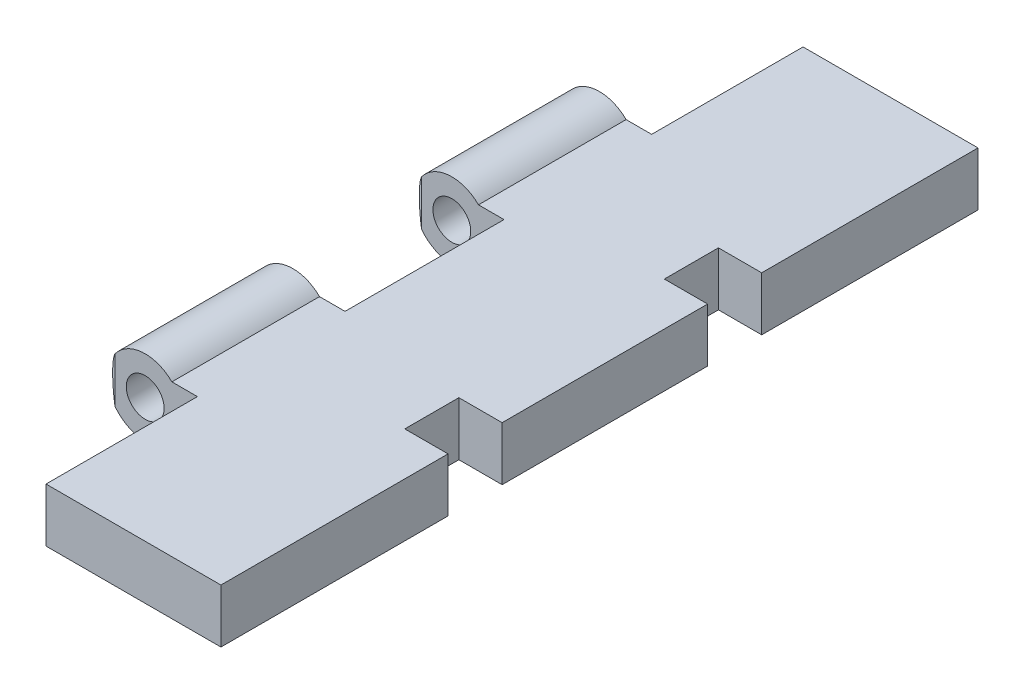
ISO-10303-21;
HEADER;
FILE_DESCRIPTION(('STEP AP214'),'2;1');
FILE_NAME('part.step','',(''),(''),'','','');
FILE_SCHEMA(('AUTOMOTIVE_DESIGN { 1 0 10303 214 1 1 1 1 }'));
ENDSEC;
DATA;
#1=APPLICATION_CONTEXT('core data for automotive mechanical design processes');
#2=APPLICATION_PROTOCOL_DEFINITION('international standard','automotive_design',2000,#1);
#3=PRODUCT_CONTEXT('',#1,'mechanical');
#4=PRODUCT('Part','Part','',(#3));
#5=PRODUCT_RELATED_PRODUCT_CATEGORY('part','',(#4));
#6=PRODUCT_DEFINITION_FORMATION('','',#4);
#7=PRODUCT_DEFINITION_CONTEXT('part definition',#1,'design');
#8=PRODUCT_DEFINITION('design','',#6,#7);
#9=PRODUCT_DEFINITION_SHAPE('','',#8);
#10=(LENGTH_UNIT() NAMED_UNIT(*) SI_UNIT(.MILLI.,.METRE.));
#11=(NAMED_UNIT(*) PLANE_ANGLE_UNIT() SI_UNIT($,.RADIAN.));
#12=(NAMED_UNIT(*) SI_UNIT($,.STERADIAN.) SOLID_ANGLE_UNIT());
#13=UNCERTAINTY_MEASURE_WITH_UNIT(LENGTH_MEASURE(1.E-05),#10,'distance_accuracy_value','');
#14=(GEOMETRIC_REPRESENTATION_CONTEXT(3) GLOBAL_UNCERTAINTY_ASSIGNED_CONTEXT((#13)) GLOBAL_UNIT_ASSIGNED_CONTEXT((#10,
#11,#12)) REPRESENTATION_CONTEXT('',''));
#15=CARTESIAN_POINT('',(0.,0.,0.));
#16=DIRECTION('',(0.,0.,1.));
#17=DIRECTION('',(1.,0.,0.));
#18=AXIS2_PLACEMENT_3D('',#15,#16,#17);
#19=CARTESIAN_POINT('',(87.6698011843901,4.79250337128365,32.453922738806));
#20=DIRECTION('',(-1.,0.,0.));
#21=DIRECTION('',(0.,0.,1.));
#22=AXIS2_PLACEMENT_3D('',#19,#20,#21);
#23=PLANE('',#22);
#24=DIRECTION('',(0.,0.,-1.));
#25=VECTOR('',#24,1.);
#26=CARTESIAN_POINT('',(87.6698011843901,2.30750337128365,32.453922738806));
#27=LINE('',#26,#25);
#28=CARTESIAN_POINT('',(87.6698011843901,2.30750337128365,54.453922738806));
#29=VERTEX_POINT('',#28);
#30=CARTESIAN_POINT('',(87.6698011843901,2.30750337128365,44.953922738806));
#31=VERTEX_POINT('',#30);
#32=EDGE_CURVE('E332',#29,#31,#27,.T.);
#33=ORIENTED_EDGE('',*,*,#32,.T.);
#34=DIRECTION('',(0.,1.,0.));
#35=VECTOR('',#34,1.);
#36=CARTESIAN_POINT('',(87.6698011843901,4.79250337128365,44.953922738806));
#37=LINE('',#36,#35);
#38=CARTESIAN_POINT('',(87.6698011843901,4.79250337128365,44.953922738806));
#39=VERTEX_POINT('',#38);
#40=EDGE_CURVE('E207',#31,#39,#37,.T.);
#41=ORIENTED_EDGE('',*,*,#40,.T.);
#42=DIRECTION('',(0.,0.,-1.));
#43=VECTOR('',#42,1.);
#44=CARTESIAN_POINT('',(87.6698011843901,4.79250337128365,32.453922738806));
#45=LINE('',#44,#43);
#46=CARTESIAN_POINT('',(87.6698011843901,4.79250337128365,54.453922738806));
#47=VERTEX_POINT('',#46);
#48=EDGE_CURVE('E324',#47,#39,#45,.T.);
#49=ORIENTED_EDGE('',*,*,#48,.F.);
#50=DIRECTION('',(0.,1.,0.));
#51=VECTOR('',#50,1.);
#52=CARTESIAN_POINT('',(87.6698011843901,1.80000337128365,54.453922738806));
#53=LINE('',#52,#51);
#54=EDGE_CURVE('E379',#29,#47,#53,.T.);
#55=ORIENTED_EDGE('',*,*,#54,.F.);
#56=EDGE_LOOP('',(#33,#41,#49,#55));
#57=FACE_BOUND('',#56,.T.);
#58=ADVANCED_FACE('F38',(#57),#23,.F.);
#59=CARTESIAN_POINT('',(87.6698011843901,4.79250337128365,42.453922738806));
#60=VERTEX_POINT('',#59);
#61=CARTESIAN_POINT('',(87.6698011843901,4.79250337128365,32.453922738806));
#62=VERTEX_POINT('',#61);
#63=EDGE_CURVE('E319',#60,#62,#45,.T.);
#64=ORIENTED_EDGE('',*,*,#63,.F.);
#65=DIRECTION('',(0.,1.,0.));
#66=VECTOR('',#65,1.);
#67=CARTESIAN_POINT('',(87.6698011843901,1.80000337128365,42.453922738806));
#68=LINE('',#67,#66);
#69=CARTESIAN_POINT('',(87.6698011843901,2.30750337128365,42.453922738806));
#70=VERTEX_POINT('',#69);
#71=EDGE_CURVE('E53',#70,#60,#68,.T.);
#72=ORIENTED_EDGE('',*,*,#71,.F.);
#73=CARTESIAN_POINT('',(87.6698011843901,2.30750337128365,32.453922738806));
#74=VERTEX_POINT('',#73);
#75=EDGE_CURVE('E329',#70,#74,#27,.T.);
#76=ORIENTED_EDGE('',*,*,#75,.T.);
#77=DIRECTION('',(0.,-1.,0.));
#78=VECTOR('',#77,1.);
#79=CARTESIAN_POINT('',(87.6698011843901,4.79250337128365,32.453922738806));
#80=LINE('',#79,#78);
#81=EDGE_CURVE('E327',#62,#74,#80,.T.);
#82=ORIENTED_EDGE('',*,*,#81,.F.);
#83=EDGE_LOOP('',(#64,#72,#76,#82));
#84=FACE_BOUND('',#83,.T.);
#85=ADVANCED_FACE('F408',(#84),#23,.F.);
#86=CARTESIAN_POINT('',(79.5830511843904,2.30750337128365,60.453922738806));
#87=DIRECTION('',(1.,0.,0.));
#88=DIRECTION('',(0.,0.,-1.));
#89=AXIS2_PLACEMENT_3D('',#86,#87,#88);
#90=PLANE('',#89);
#91=DIRECTION('',(0.,0.,-1.));
#92=VECTOR('',#91,1.);
#93=CARTESIAN_POINT('',(79.5830511843904,4.79250337128365,60.453922738806));
#94=LINE('',#93,#92);
#95=CARTESIAN_POINT('',(79.5830511843904,4.79250337128365,67.453922738806));
#96=VERTEX_POINT('',#95);
#97=CARTESIAN_POINT('',(79.5830511843904,4.79250337128365,60.453922738806));
#98=VERTEX_POINT('',#97);
#99=EDGE_CURVE('E306',#96,#98,#94,.T.);
#100=ORIENTED_EDGE('',*,*,#99,.T.);
#101=DIRECTION('',(0.,1.,0.));
#102=VECTOR('',#101,1.);
#103=CARTESIAN_POINT('',(79.5830511843904,2.30750337128365,60.453922738806));
#104=LINE('',#103,#102);
#105=CARTESIAN_POINT('',(79.5830511843904,2.30750337128365,60.453922738806));
#106=VERTEX_POINT('',#105);
#107=EDGE_CURVE('E295',#106,#98,#104,.T.);
#108=ORIENTED_EDGE('',*,*,#107,.F.);
#109=DIRECTION('',(0.,0.,-1.));
#110=VECTOR('',#109,1.);
#111=CARTESIAN_POINT('',(79.5830511843904,2.30750337128365,60.453922738806));
#112=LINE('',#111,#110);
#113=CARTESIAN_POINT('',(79.5830511843904,2.30750337128365,67.453922738806));
#114=VERTEX_POINT('',#113);
#115=EDGE_CURVE('E305',#114,#106,#112,.T.);
#116=ORIENTED_EDGE('',*,*,#115,.F.);
#117=DIRECTION('',(0.,1.,0.));
#118=VECTOR('',#117,1.);
#119=CARTESIAN_POINT('',(79.5830511843904,2.30750337128365,67.453922738806));
#120=LINE('',#119,#118);
#121=EDGE_CURVE('E309',#114,#96,#120,.T.);
#122=ORIENTED_EDGE('',*,*,#121,.T.);
#123=EDGE_LOOP('',(#100,#108,#116,#122));
#124=FACE_BOUND('',#123,.T.);
#125=ADVANCED_FACE('F479',(#124),#90,.F.);
#126=CARTESIAN_POINT('',(77.1698011843901,4.79250337128365,67.453922738806));
#127=DIRECTION('',(0.,0.,-1.));
#128=DIRECTION('',(-1.,0.,0.));
#129=AXIS2_PLACEMENT_3D('',#126,#127,#128);
#130=PLANE('',#129);
#131=DIRECTION('',(1.,0.,0.));
#132=VECTOR('',#131,1.);
#133=CARTESIAN_POINT('',(77.1698011843901,4.79250337128365,67.453922738806));
#134=LINE('',#133,#132);
#135=CARTESIAN_POINT('',(87.6698011843901,4.79250337128365,67.453922738806));
#136=VERTEX_POINT('',#135);
#137=EDGE_CURVE('E317',#96,#136,#134,.T.);
#138=ORIENTED_EDGE('',*,*,#137,.F.);
#139=ORIENTED_EDGE('',*,*,#121,.F.);
#140=DIRECTION('',(1.,0.,0.));
#141=VECTOR('',#140,1.);
#142=CARTESIAN_POINT('',(77.1698011843901,2.30750337128365,67.453922738806));
#143=LINE('',#142,#141);
#144=CARTESIAN_POINT('',(87.6698011843901,2.30750337128365,67.453922738806));
#145=VERTEX_POINT('',#144);
#146=EDGE_CURVE('E278',#114,#145,#143,.T.);
#147=ORIENTED_EDGE('',*,*,#146,.T.);
#148=DIRECTION('',(0.,-1.,0.));
#149=VECTOR('',#148,1.);
#150=CARTESIAN_POINT('',(87.6698011843901,4.79250337128365,67.453922738806));
#151=LINE('',#150,#149);
#152=EDGE_CURVE('E337',#136,#145,#151,.T.);
#153=ORIENTED_EDGE('',*,*,#152,.F.);
#154=EDGE_LOOP('',(#138,#139,#147,#153));
#155=FACE_BOUND('',#154,.T.);
#156=ADVANCED_FACE('F40',(#155),#130,.F.);
#157=CARTESIAN_POINT('',(87.6698011843901,2.30750337128365,56.953922738806));
#158=VERTEX_POINT('',#157);
#159=EDGE_CURVE('E330',#145,#158,#27,.T.);
#160=ORIENTED_EDGE('',*,*,#159,.T.);
#161=DIRECTION('',(0.,1.,0.));
#162=VECTOR('',#161,1.);
#163=CARTESIAN_POINT('',(87.6698011843901,4.79250337128365,56.953922738806));
#164=LINE('',#163,#162);
#165=CARTESIAN_POINT('',(87.6698011843901,4.79250337128365,56.953922738806));
#166=VERTEX_POINT('',#165);
#167=EDGE_CURVE('E376',#158,#166,#164,.T.);
#168=ORIENTED_EDGE('',*,*,#167,.T.);
#169=EDGE_CURVE('E321',#136,#166,#45,.T.);
#170=ORIENTED_EDGE('',*,*,#169,.F.);
#171=ORIENTED_EDGE('',*,*,#152,.T.);
#172=EDGE_LOOP('',(#160,#168,#170,#171));
#173=FACE_BOUND('',#172,.T.);
#174=ADVANCED_FACE('F463',(#173),#23,.F.);
#175=CARTESIAN_POINT('',(77.1698011843901,4.79250337128365,32.453922738806));
#176=DIRECTION('',(0.,0.,1.));
#177=DIRECTION('',(1.,0.,0.));
#178=AXIS2_PLACEMENT_3D('',#175,#176,#177);
#179=PLANE('',#178);
#180=DIRECTION('',(-1.,0.,0.));
#181=VECTOR('',#180,1.);
#182=CARTESIAN_POINT('',(77.1698011843901,2.30750337128365,32.453922738806));
#183=LINE('',#182,#181);
#184=CARTESIAN_POINT('',(79.5830511843901,2.30750337128365,32.453922738806));
#185=VERTEX_POINT('',#184);
#186=EDGE_CURVE('E320',#74,#185,#183,.T.);
#187=ORIENTED_EDGE('',*,*,#186,.T.);
#188=DIRECTION('',(0.,1.,0.));
#189=VECTOR('',#188,1.);
#190=CARTESIAN_POINT('',(79.5830511843901,2.30750337128365,32.453922738806));
#191=LINE('',#190,#189);
#192=CARTESIAN_POINT('',(79.5830511843901,4.79250337128365,32.453922738806));
#193=VERTEX_POINT('',#192);
#194=EDGE_CURVE('E275',#185,#193,#191,.T.);
#195=ORIENTED_EDGE('',*,*,#194,.T.);
#196=DIRECTION('',(-1.,0.,0.));
#197=VECTOR('',#196,1.);
#198=CARTESIAN_POINT('',(77.1698011843901,4.79250337128365,32.453922738806));
#199=LINE('',#198,#197);
#200=EDGE_CURVE('E323',#62,#193,#199,.T.);
#201=ORIENTED_EDGE('',*,*,#200,.F.);
#202=ORIENTED_EDGE('',*,*,#81,.T.);
#203=EDGE_LOOP('',(#187,#195,#201,#202));
#204=FACE_BOUND('',#203,.T.);
#205=ADVANCED_FACE('F411',(#204),#179,.F.);
#206=CARTESIAN_POINT('',(79.5830511843901,2.30750337128365,32.453922738806));
#207=DIRECTION('',(1.,0.,0.));
#208=DIRECTION('',(0.,0.,-1.));
#209=AXIS2_PLACEMENT_3D('',#206,#207,#208);
#210=PLANE('',#209);
#211=DIRECTION('',(0.,0.,-1.));
#212=VECTOR('',#211,1.);
#213=CARTESIAN_POINT('',(79.5830511843901,4.79250337128365,32.453922738806));
#214=LINE('',#213,#212);
#215=CARTESIAN_POINT('',(79.5830511843901,4.79250337128365,39.453922738806));
#216=VERTEX_POINT('',#215);
#217=EDGE_CURVE('E267',#216,#193,#214,.T.);
#218=ORIENTED_EDGE('',*,*,#217,.T.);
#219=ORIENTED_EDGE('',*,*,#194,.F.);
#220=DIRECTION('',(0.,0.,-1.));
#221=VECTOR('',#220,1.);
#222=CARTESIAN_POINT('',(79.5830511843901,2.30750337128365,32.453922738806));
#223=LINE('',#222,#221);
#224=CARTESIAN_POINT('',(79.5830511843901,2.30750337128365,39.453922738806));
#225=VERTEX_POINT('',#224);
#226=EDGE_CURVE('E266',#225,#185,#223,.T.);
#227=ORIENTED_EDGE('',*,*,#226,.F.);
#228=DIRECTION('',(0.,1.,0.));
#229=VECTOR('',#228,1.);
#230=CARTESIAN_POINT('',(79.5830511843901,2.30750337128365,39.453922738806));
#231=LINE('',#230,#229);
#232=EDGE_CURVE('E270',#225,#216,#231,.T.);
#233=ORIENTED_EDGE('',*,*,#232,.T.);
#234=EDGE_LOOP('',(#218,#219,#227,#233));
#235=FACE_BOUND('',#234,.T.);
#236=ADVANCED_FACE('F414',(#235),#210,.F.);
#237=CARTESIAN_POINT('',(79.5830511843903,2.30750337128365,46.278922738806));
#238=DIRECTION('',(1.,0.,0.));
#239=DIRECTION('',(0.,0.,-1.));
#240=AXIS2_PLACEMENT_3D('',#237,#238,#239);
#241=PLANE('',#240);
#242=DIRECTION('',(0.,0.,-1.));
#243=VECTOR('',#242,1.);
#244=CARTESIAN_POINT('',(79.5830511843903,4.79250337128365,46.278922738806));
#245=LINE('',#244,#243);
#246=CARTESIAN_POINT('',(79.5830511843903,4.79250337128365,53.628922738806));
#247=VERTEX_POINT('',#246);
#248=CARTESIAN_POINT('',(79.5830511843903,4.79250337128365,46.278922738806));
#249=VERTEX_POINT('',#248);
#250=EDGE_CURVE('E285',#247,#249,#245,.T.);
#251=ORIENTED_EDGE('',*,*,#250,.T.);
#252=DIRECTION('',(0.,1.,0.));
#253=VECTOR('',#252,1.);
#254=CARTESIAN_POINT('',(79.5830511843903,2.30750337128365,46.278922738806));
#255=LINE('',#254,#253);
#256=CARTESIAN_POINT('',(79.5830511843903,2.30750337128365,46.278922738806));
#257=VERTEX_POINT('',#256);
#258=EDGE_CURVE('E273',#257,#249,#255,.T.);
#259=ORIENTED_EDGE('',*,*,#258,.F.);
#260=DIRECTION('',(0.,0.,-1.));
#261=VECTOR('',#260,1.);
#262=CARTESIAN_POINT('',(79.5830511843903,2.30750337128365,46.278922738806));
#263=LINE('',#262,#261);
#264=CARTESIAN_POINT('',(79.5830511843903,2.30750337128365,53.628922738806));
#265=VERTEX_POINT('',#264);
#266=EDGE_CURVE('E287',#265,#257,#263,.T.);
#267=ORIENTED_EDGE('',*,*,#266,.F.);
#268=DIRECTION('',(0.,1.,0.));
#269=VECTOR('',#268,1.);
#270=CARTESIAN_POINT('',(79.5830511843903,2.30750337128365,53.628922738806));
#271=LINE('',#270,#269);
#272=EDGE_CURVE('E290',#265,#247,#271,.T.);
#273=ORIENTED_EDGE('',*,*,#272,.T.);
#274=EDGE_LOOP('',(#251,#259,#267,#273));
#275=FACE_BOUND('',#274,.T.);
#276=ADVANCED_FACE('F437',(#275),#241,.F.);
#277=CARTESIAN_POINT('',(77.1698011843901,2.30750337128365,39.453922738806));
#278=DIRECTION('',(0.,0.,1.));
#279=DIRECTION('',(1.,0.,0.));
#280=AXIS2_PLACEMENT_3D('',#277,#278,#279);
#281=PLANE('',#280);
#282=CARTESIAN_POINT('',(77.16980118439,3.55000337128365,39.453922738806));
#283=DIRECTION('',(0.,0.,1.));
#284=DIRECTION('',(1.,0.,0.));
#285=AXIS2_PLACEMENT_3D('',#282,#283,#284);
#286=CIRCLE('',#285,0.874999999999998);
#287=CARTESIAN_POINT('',(78.04480118439,3.55000337128365,39.453922738806));
#288=VERTEX_POINT('',#287);
#289=EDGE_CURVE('E245',#288,#288,#286,.F.);
#290=ORIENTED_EDGE('',*,*,#289,.F.);
#291=EDGE_LOOP('',(#290));
#292=FACE_BOUND('',#291,.T.);
#293=CARTESIAN_POINT('',(77.1698011843901,3.55000337128365,39.453922738806));
#294=DIRECTION('',(0.,0.,-1.));
#295=DIRECTION('',(-1.,0.,0.));
#296=AXIS2_PLACEMENT_3D('',#293,#294,#295);
#297=CIRCLE('',#296,1.75);
#298=CARTESIAN_POINT('',(78.4021541167921,2.30750337128365,39.453922738806));
#299=VERTEX_POINT('',#298);
#300=CARTESIAN_POINT('',(75.7698011843901,2.50000337128364,39.453922738806));
#301=VERTEX_POINT('',#300);
#302=EDGE_CURVE('E253',#299,#301,#297,.T.);
#303=ORIENTED_EDGE('',*,*,#302,.T.);
#304=DIRECTION('',(0.,1.,0.));
#305=VECTOR('',#304,1.);
#306=CARTESIAN_POINT('',(75.7698011843901,1.80000337128365,39.453922738806));
#307=LINE('',#306,#305);
#308=CARTESIAN_POINT('',(75.7698011843901,4.60000337128365,39.453922738806));
#309=VERTEX_POINT('',#308);
#310=EDGE_CURVE('E234',#301,#309,#307,.T.);
#311=ORIENTED_EDGE('',*,*,#310,.T.);
#312=CARTESIAN_POINT('',(78.4021541167921,4.79250337128365,39.453922738806));
#313=VERTEX_POINT('',#312);
#314=EDGE_CURVE('E252',#309,#313,#297,.T.);
#315=ORIENTED_EDGE('',*,*,#314,.T.);
#316=DIRECTION('',(1.,0.,0.));
#317=VECTOR('',#316,1.);
#318=CARTESIAN_POINT('',(77.1698011843901,4.79250337128365,39.453922738806));
#319=LINE('',#318,#317);
#320=EDGE_CURVE('E271',#313,#216,#319,.T.);
#321=ORIENTED_EDGE('',*,*,#320,.T.);
#322=ORIENTED_EDGE('',*,*,#232,.F.);
#323=DIRECTION('',(1.,0.,0.));
#324=VECTOR('',#323,1.);
#325=CARTESIAN_POINT('',(77.1698011843901,2.30750337128365,39.453922738806));
#326=LINE('',#325,#324);
#327=EDGE_CURVE('E264',#299,#225,#326,.T.);
#328=ORIENTED_EDGE('',*,*,#327,.F.);
#329=EDGE_LOOP('',(#303,#311,#315,#321,#322,#328));
#330=FACE_BOUND('',#329,.T.);
#331=ADVANCED_FACE('F420',(#292,#330),#281,.F.);
#332=CARTESIAN_POINT('',(53.7620108936019,2.30750337128365,32.4701915934344));
#333=DIRECTION('',(0.,1.,0.));
#334=DIRECTION('',(0.,0.,1.));
#335=AXIS2_PLACEMENT_3D('',#332,#333,#334);
#336=PLANE('',#335);
#337=DIRECTION('',(1.,0.,0.));
#338=VECTOR('',#337,1.);
#339=CARTESIAN_POINT('',(75.4178011843901,2.30750337128365,44.953922738806));
#340=LINE('',#339,#338);
#341=CARTESIAN_POINT('',(85.6698011843901,2.30750337128365,44.953922738806));
#342=VERTEX_POINT('',#341);
#343=EDGE_CURVE('E200',#342,#31,#340,.T.);
#344=ORIENTED_EDGE('',*,*,#343,.T.);
#345=ORIENTED_EDGE('',*,*,#32,.F.);
#346=DIRECTION('',(-1.,0.,0.));
#347=VECTOR('',#346,1.);
#348=CARTESIAN_POINT('',(53.7620108936019,2.30750337128365,54.453922738806));
#349=LINE('',#348,#347);
#350=CARTESIAN_POINT('',(85.6698011843901,2.30750337128365,54.453922738806));
#351=VERTEX_POINT('',#350);
#352=EDGE_CURVE('E365',#29,#351,#349,.T.);
#353=ORIENTED_EDGE('',*,*,#352,.T.);
#354=DIRECTION('',(0.,0.,1.));
#355=VECTOR('',#354,1.);
#356=CARTESIAN_POINT('',(85.6698011843901,2.30750337128365,32.4701915934344));
#357=LINE('',#356,#355);
#358=CARTESIAN_POINT('',(85.6698011843901,2.30750337128365,56.953922738806));
#359=VERTEX_POINT('',#358);
#360=EDGE_CURVE('E227',#351,#359,#357,.T.);
#361=ORIENTED_EDGE('',*,*,#360,.T.);
#362=DIRECTION('',(1.,0.,0.));
#363=VECTOR('',#362,1.);
#364=CARTESIAN_POINT('',(75.4178011843901,2.30750337128365,56.953922738806));
#365=LINE('',#364,#363);
#366=EDGE_CURVE('E375',#359,#158,#365,.T.);
#367=ORIENTED_EDGE('',*,*,#366,.T.);
#368=ORIENTED_EDGE('',*,*,#159,.F.);
#369=ORIENTED_EDGE('',*,*,#146,.F.);
#370=ORIENTED_EDGE('',*,*,#115,.T.);
#371=DIRECTION('',(-1.,0.,0.));
#372=VECTOR('',#371,1.);
#373=CARTESIAN_POINT('',(77.1698011843904,2.30750337128365,60.453922738806));
#374=LINE('',#373,#372);
#375=CARTESIAN_POINT('',(78.4021541167921,2.30750337128365,60.453922738806));
#376=VERTEX_POINT('',#375);
#377=EDGE_CURVE('E302',#106,#376,#374,.T.);
#378=ORIENTED_EDGE('',*,*,#377,.T.);
#379=DIRECTION('',(0.,0.,-1.));
#380=VECTOR('',#379,1.);
#381=CARTESIAN_POINT('',(78.4021541167921,2.30750337128365,39.453922738806));
#382=LINE('',#381,#380);
#383=CARTESIAN_POINT('',(78.4021541167921,2.30750337128365,53.628922738806));
#384=VERTEX_POINT('',#383);
#385=EDGE_CURVE('E256',#376,#384,#382,.T.);
#386=ORIENTED_EDGE('',*,*,#385,.T.);
#387=DIRECTION('',(1.,0.,0.));
#388=VECTOR('',#387,1.);
#389=CARTESIAN_POINT('',(77.1698011843903,2.30750337128365,53.628922738806));
#390=LINE('',#389,#388);
#391=EDGE_CURVE('E284',#384,#265,#390,.T.);
#392=ORIENTED_EDGE('',*,*,#391,.T.);
#393=ORIENTED_EDGE('',*,*,#266,.T.);
#394=DIRECTION('',(-1.,0.,0.));
#395=VECTOR('',#394,1.);
#396=CARTESIAN_POINT('',(77.1698011843902,2.30750337128365,46.278922738806));
#397=LINE('',#396,#395);
#398=CARTESIAN_POINT('',(78.4021541167921,2.30750337128365,46.278922738806));
#399=VERTEX_POINT('',#398);
#400=EDGE_CURVE('E281',#257,#399,#397,.T.);
#401=ORIENTED_EDGE('',*,*,#400,.T.);
#402=EDGE_CURVE('E260',#399,#299,#382,.T.);
#403=ORIENTED_EDGE('',*,*,#402,.T.);
#404=ORIENTED_EDGE('',*,*,#327,.T.);
#405=ORIENTED_EDGE('',*,*,#226,.T.);
#406=ORIENTED_EDGE('',*,*,#186,.F.);
#407=ORIENTED_EDGE('',*,*,#75,.F.);
#408=DIRECTION('',(-1.,0.,0.));
#409=VECTOR('',#408,1.);
#410=CARTESIAN_POINT('',(53.7620108936019,2.30750337128365,42.453922738806));
#411=LINE('',#410,#409);
#412=CARTESIAN_POINT('',(85.6698011843901,2.30750337128365,42.453922738806));
#413=VERTEX_POINT('',#412);
#414=EDGE_CURVE('E223',#70,#413,#411,.T.);
#415=ORIENTED_EDGE('',*,*,#414,.T.);
#416=DIRECTION('',(0.,0.,1.));
#417=VECTOR('',#416,1.);
#418=CARTESIAN_POINT('',(85.6698011843901,2.30750337128365,32.4701915934344));
#419=LINE('',#418,#417);
#420=EDGE_CURVE('E216',#413,#342,#419,.T.);
#421=ORIENTED_EDGE('',*,*,#420,.T.);
#422=EDGE_LOOP('',(#344,#345,#353,#361,#367,#368,#369,#370,#378,#386,#392,#393,#401,#403,#404,
#405,#406,#407,#415,#421));
#423=FACE_BOUND('',#422,.T.);
#424=ADVANCED_FACE('F221',(#423),#336,.F.);
#425=CARTESIAN_POINT('',(77.1698011843903,2.30750337128365,53.628922738806));
#426=DIRECTION('',(0.,0.,1.));
#427=DIRECTION('',(1.,0.,0.));
#428=AXIS2_PLACEMENT_3D('',#425,#426,#427);
#429=PLANE('',#428);
#430=ORIENTED_EDGE('',*,*,#391,.F.);
#431=CARTESIAN_POINT('',(77.1698011843901,3.55000337128365,53.628922738806));
#432=DIRECTION('',(0.,0.,1.));
#433=DIRECTION('',(1.,0.,0.));
#434=AXIS2_PLACEMENT_3D('',#431,#432,#433);
#435=CIRCLE('',#434,1.75);
#436=CARTESIAN_POINT('',(75.5198011843901,2.96690818179915,53.628922738806));
#437=VERTEX_POINT('',#436);
#438=EDGE_CURVE('E61',#384,#437,#435,.F.);
#439=ORIENTED_EDGE('',*,*,#438,.T.);
#440=DIRECTION('',(0.,-1.,0.));
#441=VECTOR('',#440,1.);
#442=CARTESIAN_POINT('',(75.5198011843901,1.80000337128365,53.628922738806));
#443=LINE('',#442,#441);
#444=CARTESIAN_POINT('',(75.5198011843901,4.13309856076815,53.628922738806));
#445=VERTEX_POINT('',#444);
#446=EDGE_CURVE('E355',#445,#437,#443,.T.);
#447=ORIENTED_EDGE('',*,*,#446,.F.);
#448=CARTESIAN_POINT('',(78.4021541167921,4.79250337128365,53.628922738806));
#449=VERTEX_POINT('',#448);
#450=EDGE_CURVE('E225',#445,#449,#435,.F.);
#451=ORIENTED_EDGE('',*,*,#450,.T.);
#452=DIRECTION('',(1.,0.,0.));
#453=VECTOR('',#452,1.);
#454=CARTESIAN_POINT('',(77.1698011843903,4.79250337128365,53.628922738806));
#455=LINE('',#454,#453);
#456=EDGE_CURVE('E294',#449,#247,#455,.T.);
#457=ORIENTED_EDGE('',*,*,#456,.T.);
#458=ORIENTED_EDGE('',*,*,#272,.F.);
#459=EDGE_LOOP('',(#430,#439,#447,#451,#457,#458));
#460=FACE_BOUND('',#459,.T.);
#461=CARTESIAN_POINT('',(77.16980118439,3.55000337128365,53.628922738806));
#462=DIRECTION('',(0.,0.,1.));
#463=DIRECTION('',(1.,0.,0.));
#464=AXIS2_PLACEMENT_3D('',#461,#462,#463);
#465=CIRCLE('',#464,0.874999999999998);
#466=CARTESIAN_POINT('',(78.04480118439,3.55000337128365,53.628922738806));
#467=VERTEX_POINT('',#466);
#468=EDGE_CURVE('E231',#467,#467,#465,.T.);
#469=ORIENTED_EDGE('',*,*,#468,.T.);
#470=EDGE_LOOP('',(#469));
#471=FACE_BOUND('',#470,.T.);
#472=ADVANCED_FACE('F442',(#460,#471),#429,.F.);
#473=CARTESIAN_POINT('',(53.7620108936019,4.79250337128365,32.4701915934344));
#474=DIRECTION('',(0.,1.,0.));
#475=DIRECTION('',(0.,0.,1.));
#476=AXIS2_PLACEMENT_3D('',#473,#474,#475);
#477=PLANE('',#476);
#478=ORIENTED_EDGE('',*,*,#48,.T.);
#479=DIRECTION('',(1.,0.,0.));
#480=VECTOR('',#479,1.);
#481=CARTESIAN_POINT('',(75.4178011843901,4.79250337128365,44.953922738806));
#482=LINE('',#481,#480);
#483=CARTESIAN_POINT('',(85.6698011843901,4.79250337128365,44.953922738806));
#484=VERTEX_POINT('',#483);
#485=EDGE_CURVE('E211',#484,#39,#482,.T.);
#486=ORIENTED_EDGE('',*,*,#485,.F.);
#487=DIRECTION('',(0.,0.,1.));
#488=VECTOR('',#487,1.);
#489=CARTESIAN_POINT('',(85.6698011843901,4.79250337128365,32.4701915934344));
#490=LINE('',#489,#488);
#491=CARTESIAN_POINT('',(85.6698011843901,4.79250337128365,42.453922738806));
#492=VERTEX_POINT('',#491);
#493=EDGE_CURVE('E11',#492,#484,#490,.T.);
#494=ORIENTED_EDGE('',*,*,#493,.F.);
#495=DIRECTION('',(-1.,0.,0.));
#496=VECTOR('',#495,1.);
#497=CARTESIAN_POINT('',(53.7620108936019,4.79250337128365,42.453922738806));
#498=LINE('',#497,#496);
#499=EDGE_CURVE('E46',#60,#492,#498,.T.);
#500=ORIENTED_EDGE('',*,*,#499,.F.);
#501=ORIENTED_EDGE('',*,*,#63,.T.);
#502=ORIENTED_EDGE('',*,*,#200,.T.);
#503=ORIENTED_EDGE('',*,*,#217,.F.);
#504=ORIENTED_EDGE('',*,*,#320,.F.);
#505=DIRECTION('',(0.,0.,-1.));
#506=VECTOR('',#505,1.);
#507=CARTESIAN_POINT('',(78.4021541167921,4.79250337128365,39.453922738806));
#508=LINE('',#507,#506);
#509=CARTESIAN_POINT('',(78.4021541167921,4.79250337128365,46.278922738806));
#510=VERTEX_POINT('',#509);
#511=EDGE_CURVE('E263',#510,#313,#508,.T.);
#512=ORIENTED_EDGE('',*,*,#511,.F.);
#513=DIRECTION('',(-1.,0.,0.));
#514=VECTOR('',#513,1.);
#515=CARTESIAN_POINT('',(77.1698011843902,4.79250337128365,46.278922738806));
#516=LINE('',#515,#514);
#517=EDGE_CURVE('E291',#249,#510,#516,.T.);
#518=ORIENTED_EDGE('',*,*,#517,.F.);
#519=ORIENTED_EDGE('',*,*,#250,.F.);
#520=ORIENTED_EDGE('',*,*,#456,.F.);
#521=CARTESIAN_POINT('',(78.4021541167921,4.79250337128365,60.453922738806));
#522=VERTEX_POINT('',#521);
#523=EDGE_CURVE('E259',#522,#449,#508,.T.);
#524=ORIENTED_EDGE('',*,*,#523,.F.);
#525=DIRECTION('',(-1.,0.,0.));
#526=VECTOR('',#525,1.);
#527=CARTESIAN_POINT('',(77.1698011843904,4.79250337128365,60.453922738806));
#528=LINE('',#527,#526);
#529=EDGE_CURVE('E310',#98,#522,#528,.T.);
#530=ORIENTED_EDGE('',*,*,#529,.F.);
#531=ORIENTED_EDGE('',*,*,#99,.F.);
#532=ORIENTED_EDGE('',*,*,#137,.T.);
#533=ORIENTED_EDGE('',*,*,#169,.T.);
#534=DIRECTION('',(1.,0.,0.));
#535=VECTOR('',#534,1.);
#536=CARTESIAN_POINT('',(75.4178011843901,4.79250337128365,56.953922738806));
#537=LINE('',#536,#535);
#538=CARTESIAN_POINT('',(85.6698011843901,4.79250337128365,56.953922738806));
#539=VERTEX_POINT('',#538);
#540=EDGE_CURVE('E380',#539,#166,#537,.T.);
#541=ORIENTED_EDGE('',*,*,#540,.F.);
#542=DIRECTION('',(0.,0.,1.));
#543=VECTOR('',#542,1.);
#544=CARTESIAN_POINT('',(85.6698011843901,4.79250337128365,32.4701915934344));
#545=LINE('',#544,#543);
#546=CARTESIAN_POINT('',(85.6698011843901,4.79250337128365,54.453922738806));
#547=VERTEX_POINT('',#546);
#548=EDGE_CURVE('E357',#547,#539,#545,.T.);
#549=ORIENTED_EDGE('',*,*,#548,.F.);
#550=DIRECTION('',(-1.,0.,0.));
#551=VECTOR('',#550,1.);
#552=CARTESIAN_POINT('',(53.7620108936019,4.79250337128365,54.453922738806));
#553=LINE('',#552,#551);
#554=EDGE_CURVE('E360',#47,#547,#553,.T.);
#555=ORIENTED_EDGE('',*,*,#554,.F.);
#556=EDGE_LOOP('',(#478,#486,#494,#500,#501,#502,#503,#504,#512,#518,#519,#520,#524,#530,#531,
#532,#533,#541,#549,#555));
#557=FACE_BOUND('',#556,.T.);
#558=ADVANCED_FACE('F367',(#557),#477,.T.);
#559=CARTESIAN_POINT('',(77.1698011843904,2.30750337128365,60.453922738806));
#560=DIRECTION('',(0.,0.,-1.));
#561=DIRECTION('',(-1.,0.,0.));
#562=AXIS2_PLACEMENT_3D('',#559,#560,#561);
#563=PLANE('',#562);
#564=CARTESIAN_POINT('',(77.16980118439,3.55000337128365,60.453922738806));
#565=DIRECTION('',(0.,0.,-1.));
#566=DIRECTION('',(-1.,0.,0.));
#567=AXIS2_PLACEMENT_3D('',#564,#565,#566);
#568=CIRCLE('',#567,0.874999999999998);
#569=CARTESIAN_POINT('',(76.29480118439,3.55000337128365,60.453922738806));
#570=VERTEX_POINT('',#569);
#571=EDGE_CURVE('E242',#570,#570,#568,.F.);
#572=ORIENTED_EDGE('',*,*,#571,.F.);
#573=EDGE_LOOP('',(#572));
#574=FACE_BOUND('',#573,.T.);
#575=CARTESIAN_POINT('',(77.1698011843901,3.55000337128365,60.453922738806));
#576=DIRECTION('',(0.,0.,-1.));
#577=DIRECTION('',(-1.,0.,0.));
#578=AXIS2_PLACEMENT_3D('',#575,#576,#577);
#579=CIRCLE('',#578,1.75);
#580=CARTESIAN_POINT('',(75.7698011843901,4.60000337128367,60.453922738806));
#581=VERTEX_POINT('',#580);
#582=EDGE_CURVE('E248',#581,#522,#579,.T.);
#583=ORIENTED_EDGE('',*,*,#582,.F.);
#584=DIRECTION('',(0.,1.,0.));
#585=VECTOR('',#584,1.);
#586=CARTESIAN_POINT('',(75.7698011843901,1.80000337128365,60.453922738806));
#587=LINE('',#586,#585);
#588=CARTESIAN_POINT('',(75.7698011843901,2.50000337128365,60.453922738806));
#589=VERTEX_POINT('',#588);
#590=EDGE_CURVE('E235',#589,#581,#587,.T.);
#591=ORIENTED_EDGE('',*,*,#590,.F.);
#592=EDGE_CURVE('E249',#376,#589,#579,.T.);
#593=ORIENTED_EDGE('',*,*,#592,.F.);
#594=ORIENTED_EDGE('',*,*,#377,.F.);
#595=ORIENTED_EDGE('',*,*,#107,.T.);
#596=ORIENTED_EDGE('',*,*,#529,.T.);
#597=EDGE_LOOP('',(#583,#591,#593,#594,#595,#596));
#598=FACE_BOUND('',#597,.T.);
#599=ADVANCED_FACE('F451',(#574,#598),#563,.F.);
#600=CARTESIAN_POINT('',(77.1698011843901,3.55000337128365,39.453922738806));
#601=DIRECTION('',(0.,0.,-1.));
#602=DIRECTION('',(-1.,0.,0.));
#603=AXIS2_PLACEMENT_3D('',#600,#601,#602);
#604=CYLINDRICAL_SURFACE('',#603,1.75);
#605=ORIENTED_EDGE('',*,*,#438,.F.);
#606=ORIENTED_EDGE('',*,*,#385,.F.);
#607=ORIENTED_EDGE('',*,*,#592,.T.);
#608=CARTESIAN_POINT('',(77.1698011843901,3.55000337128365,61.4339227388059));
#609=DIRECTION('',(0.573462344363326,0.,-0.819231920519042));
#610=DIRECTION('',(-0.819231920519042,0.,-0.573462344363326));
#611=AXIS2_PLACEMENT_3D('',#608,#609,#610);
#612=ELLIPSE('',#611,2.1361472327534,1.75);
#613=EDGE_CURVE('E353',#581,#589,#612,.F.);
#614=ORIENTED_EDGE('',*,*,#613,.F.);
#615=ORIENTED_EDGE('',*,*,#582,.T.);
#616=ORIENTED_EDGE('',*,*,#523,.T.);
#617=ORIENTED_EDGE('',*,*,#450,.F.);
#618=CARTESIAN_POINT('',(77.1698011843901,3.55000337128365,52.473922738806));
#619=DIRECTION('',(0.573462344363328,0.,0.819231920519041));
#620=DIRECTION('',(0.819231920519041,0.,-0.573462344363328));
#621=AXIS2_PLACEMENT_3D('',#618,#619,#620);
#622=ELLIPSE('',#621,2.1361472327534,1.75);
#623=EDGE_CURVE('E350',#437,#445,#622,.F.);
#624=ORIENTED_EDGE('',*,*,#623,.F.);
#625=EDGE_LOOP('',(#605,#606,#607,#614,#615,#616,#617,#624));
#626=FACE_BOUND('',#625,.T.);
#627=ADVANCED_FACE('F446',(#626),#604,.T.);
#628=CARTESIAN_POINT('',(77.1698011843901,3.55000337128365,38.473922738806));
#629=DIRECTION('',(0.57346234436333,0.,0.819231920519039));
#630=DIRECTION('',(0.819231920519039,0.,-0.57346234436333));
#631=AXIS2_PLACEMENT_3D('',#628,#629,#630);
#632=ELLIPSE('',#631,2.1361472327534,1.75);
#633=EDGE_CURVE('E348',#301,#309,#632,.F.);
#634=ORIENTED_EDGE('',*,*,#633,.F.);
#635=ORIENTED_EDGE('',*,*,#302,.F.);
#636=ORIENTED_EDGE('',*,*,#402,.F.);
#637=CARTESIAN_POINT('',(77.1698011843901,3.55000337128365,46.278922738806));
#638=DIRECTION('',(0.,0.,-1.));
#639=DIRECTION('',(-1.,0.,0.));
#640=AXIS2_PLACEMENT_3D('',#637,#638,#639);
#641=CIRCLE('',#640,1.75);
#642=CARTESIAN_POINT('',(75.7698011843901,2.50000337128365,46.278922738806));
#643=VERTEX_POINT('',#642);
#644=EDGE_CURVE('E340',#643,#399,#641,.F.);
#645=ORIENTED_EDGE('',*,*,#644,.F.);
#646=CARTESIAN_POINT('',(77.1698011843901,3.55000337128365,47.258922738806));
#647=DIRECTION('',(0.573462344363331,0.,-0.819231920519038));
#648=DIRECTION('',(-0.819231920519038,0.,-0.573462344363331));
#649=AXIS2_PLACEMENT_3D('',#646,#647,#648);
#650=ELLIPSE('',#649,2.1361472327534,1.75);
#651=CARTESIAN_POINT('',(75.7698011843901,4.60000337128365,46.278922738806));
#652=VERTEX_POINT('',#651);
#653=EDGE_CURVE('E237',#652,#643,#650,.F.);
#654=ORIENTED_EDGE('',*,*,#653,.F.);
#655=EDGE_CURVE('E341',#510,#652,#641,.F.);
#656=ORIENTED_EDGE('',*,*,#655,.F.);
#657=ORIENTED_EDGE('',*,*,#511,.T.);
#658=ORIENTED_EDGE('',*,*,#314,.F.);
#659=EDGE_LOOP('',(#634,#635,#636,#645,#654,#656,#657,#658));
#660=FACE_BOUND('',#659,.T.);
#661=ADVANCED_FACE('F428',(#660),#604,.T.);
#662=CARTESIAN_POINT('',(77.1698011843902,2.30750337128365,46.278922738806));
#663=DIRECTION('',(0.,0.,-1.));
#664=DIRECTION('',(-1.,0.,0.));
#665=AXIS2_PLACEMENT_3D('',#662,#663,#664);
#666=PLANE('',#665);
#667=CARTESIAN_POINT('',(77.16980118439,3.55000337128365,46.278922738806));
#668=DIRECTION('',(0.,0.,-1.));
#669=DIRECTION('',(-1.,0.,0.));
#670=AXIS2_PLACEMENT_3D('',#667,#668,#669);
#671=CIRCLE('',#670,0.874999999999998);
#672=CARTESIAN_POINT('',(76.29480118439,3.55000337128365,46.278922738806));
#673=VERTEX_POINT('',#672);
#674=EDGE_CURVE('E241',#673,#673,#671,.F.);
#675=ORIENTED_EDGE('',*,*,#674,.F.);
#676=EDGE_LOOP('',(#675));
#677=FACE_BOUND('',#676,.T.);
#678=ORIENTED_EDGE('',*,*,#655,.T.);
#679=DIRECTION('',(0.,-1.,0.));
#680=VECTOR('',#679,1.);
#681=CARTESIAN_POINT('',(75.7698011843901,2.30750337128365,46.278922738806));
#682=LINE('',#681,#680);
#683=EDGE_CURVE('E343',#652,#643,#682,.T.);
#684=ORIENTED_EDGE('',*,*,#683,.T.);
#685=ORIENTED_EDGE('',*,*,#644,.T.);
#686=ORIENTED_EDGE('',*,*,#400,.F.);
#687=ORIENTED_EDGE('',*,*,#258,.T.);
#688=ORIENTED_EDGE('',*,*,#517,.T.);
#689=EDGE_LOOP('',(#678,#684,#685,#686,#687,#688));
#690=FACE_BOUND('',#689,.T.);
#691=ADVANCED_FACE('F433',(#677,#690),#666,.F.);
#692=CARTESIAN_POINT('',(77.16980118439,3.55000337128365,67.4539227388059));
#693=DIRECTION('',(0.,0.,-1.));
#694=DIRECTION('',(-1.,0.,0.));
#695=AXIS2_PLACEMENT_3D('',#692,#693,#694);
#696=CYLINDRICAL_SURFACE('',#695,0.874999999999998);
#697=ORIENTED_EDGE('',*,*,#674,.T.);
#698=EDGE_LOOP('',(#697));
#699=FACE_BOUND('',#698,.T.);
#700=ORIENTED_EDGE('',*,*,#289,.T.);
#701=EDGE_LOOP('',(#700));
#702=FACE_BOUND('',#701,.T.);
#703=ADVANCED_FACE('F490',(#699,#702),#696,.F.);
#704=ORIENTED_EDGE('',*,*,#468,.F.);
#705=EDGE_LOOP('',(#704));
#706=FACE_BOUND('',#705,.T.);
#707=ORIENTED_EDGE('',*,*,#571,.T.);
#708=EDGE_LOOP('',(#707));
#709=FACE_BOUND('',#708,.T.);
#710=ADVANCED_FACE('F496',(#706,#709),#696,.F.);
#711=CARTESIAN_POINT('',(75.7698011843901,1.80000337128365,46.278922738806));
#712=DIRECTION('',(0.573462344363331,0.,-0.819231920519038));
#713=DIRECTION('',(-0.819231920519038,0.,-0.573462344363331));
#714=AXIS2_PLACEMENT_3D('',#711,#712,#713);
#715=PLANE('',#714);
#716=ORIENTED_EDGE('',*,*,#653,.T.);
#717=ORIENTED_EDGE('',*,*,#683,.F.);
#718=EDGE_LOOP('',(#716,#717));
#719=FACE_BOUND('',#718,.T.);
#720=ADVANCED_FACE('F503',(#719),#715,.F.);
#721=CARTESIAN_POINT('',(75.7698011843901,1.80000337128365,39.453922738806));
#722=DIRECTION('',(0.57346234436333,0.,0.819231920519039));
#723=DIRECTION('',(0.819231920519039,0.,-0.57346234436333));
#724=AXIS2_PLACEMENT_3D('',#721,#722,#723);
#725=PLANE('',#724);
#726=ORIENTED_EDGE('',*,*,#310,.F.);
#727=ORIENTED_EDGE('',*,*,#633,.T.);
#728=EDGE_LOOP('',(#726,#727));
#729=FACE_BOUND('',#728,.T.);
#730=ADVANCED_FACE('F570',(#729),#725,.F.);
#731=CARTESIAN_POINT('',(75.7698011843901,1.80000337128365,53.453922738806));
#732=DIRECTION('',(0.573462344363328,0.,0.819231920519041));
#733=DIRECTION('',(0.819231920519041,0.,-0.573462344363328));
#734=AXIS2_PLACEMENT_3D('',#731,#732,#733);
#735=PLANE('',#734);
#736=ORIENTED_EDGE('',*,*,#623,.T.);
#737=ORIENTED_EDGE('',*,*,#446,.T.);
#738=EDGE_LOOP('',(#736,#737));
#739=FACE_BOUND('',#738,.T.);
#740=ADVANCED_FACE('F580',(#739),#735,.F.);
#741=CARTESIAN_POINT('',(75.7698011843901,1.80000337128365,60.453922738806));
#742=DIRECTION('',(0.573462344363326,0.,-0.819231920519042));
#743=DIRECTION('',(-0.819231920519042,0.,-0.573462344363326));
#744=AXIS2_PLACEMENT_3D('',#741,#742,#743);
#745=PLANE('',#744);
#746=ORIENTED_EDGE('',*,*,#613,.T.);
#747=ORIENTED_EDGE('',*,*,#590,.T.);
#748=EDGE_LOOP('',(#746,#747));
#749=FACE_BOUND('',#748,.T.);
#750=ADVANCED_FACE('F588',(#749),#745,.F.);
#751=CARTESIAN_POINT('',(85.6698011843901,1.80000337128365,57.453922738806));
#752=DIRECTION('',(-1.,0.,0.));
#753=DIRECTION('',(0.,0.,1.));
#754=AXIS2_PLACEMENT_3D('',#751,#752,#753);
#755=PLANE('',#754);
#756=ORIENTED_EDGE('',*,*,#548,.T.);
#757=DIRECTION('',(0.,1.,0.));
#758=VECTOR('',#757,1.);
#759=CARTESIAN_POINT('',(85.6698011843901,4.79250337128365,56.953922738806));
#760=LINE('',#759,#758);
#761=EDGE_CURVE('E371',#359,#539,#760,.T.);
#762=ORIENTED_EDGE('',*,*,#761,.F.);
#763=ORIENTED_EDGE('',*,*,#360,.F.);
#764=DIRECTION('',(0.,1.,0.));
#765=VECTOR('',#764,1.);
#766=CARTESIAN_POINT('',(85.6698011843901,1.80000337128365,54.453922738806));
#767=LINE('',#766,#765);
#768=EDGE_CURVE('E386',#351,#547,#767,.T.);
#769=ORIENTED_EDGE('',*,*,#768,.T.);
#770=EDGE_LOOP('',(#756,#762,#763,#769));
#771=FACE_BOUND('',#770,.T.);
#772=ADVANCED_FACE('F397',(#771),#755,.F.);
#773=CARTESIAN_POINT('',(85.6698011843901,1.80000337128365,54.453922738806));
#774=DIRECTION('',(0.,0.,-1.));
#775=DIRECTION('',(-1.,0.,0.));
#776=AXIS2_PLACEMENT_3D('',#773,#774,#775);
#777=PLANE('',#776);
#778=ORIENTED_EDGE('',*,*,#54,.T.);
#779=ORIENTED_EDGE('',*,*,#554,.T.);
#780=ORIENTED_EDGE('',*,*,#768,.F.);
#781=ORIENTED_EDGE('',*,*,#352,.F.);
#782=EDGE_LOOP('',(#778,#779,#780,#781));
#783=FACE_BOUND('',#782,.T.);
#784=ADVANCED_FACE('F400',(#783),#777,.F.);
#785=CARTESIAN_POINT('',(85.6698011843901,1.80000337128365,42.453922738806));
#786=DIRECTION('',(-1.,0.,0.));
#787=DIRECTION('',(0.,0.,1.));
#788=AXIS2_PLACEMENT_3D('',#785,#786,#787);
#789=PLANE('',#788);
#790=ORIENTED_EDGE('',*,*,#493,.T.);
#791=DIRECTION('',(0.,1.,0.));
#792=VECTOR('',#791,1.);
#793=CARTESIAN_POINT('',(85.6698011843901,4.79250337128365,44.953922738806));
#794=LINE('',#793,#792);
#795=EDGE_CURVE('E204',#342,#484,#794,.T.);
#796=ORIENTED_EDGE('',*,*,#795,.F.);
#797=ORIENTED_EDGE('',*,*,#420,.F.);
#798=DIRECTION('',(0.,1.,0.));
#799=VECTOR('',#798,1.);
#800=CARTESIAN_POINT('',(85.6698011843901,1.80000337128365,42.453922738806));
#801=LINE('',#800,#799);
#802=EDGE_CURVE('E362',#413,#492,#801,.T.);
#803=ORIENTED_EDGE('',*,*,#802,.T.);
#804=EDGE_LOOP('',(#790,#796,#797,#803));
#805=FACE_BOUND('',#804,.T.);
#806=ADVANCED_FACE('F214',(#805),#789,.F.);
#807=CARTESIAN_POINT('',(87.6698011843901,1.80000337128365,42.453922738806));
#808=DIRECTION('',(0.,0.,-1.));
#809=DIRECTION('',(-1.,0.,0.));
#810=AXIS2_PLACEMENT_3D('',#807,#808,#809);
#811=PLANE('',#810);
#812=ORIENTED_EDGE('',*,*,#71,.T.);
#813=ORIENTED_EDGE('',*,*,#499,.T.);
#814=ORIENTED_EDGE('',*,*,#802,.F.);
#815=ORIENTED_EDGE('',*,*,#414,.F.);
#816=EDGE_LOOP('',(#812,#813,#814,#815));
#817=FACE_BOUND('',#816,.T.);
#818=ADVANCED_FACE('F361',(#817),#811,.F.);
#819=CARTESIAN_POINT('',(75.4178011843901,4.79250337128365,56.953922738806));
#820=DIRECTION('',(0.,0.,-1.));
#821=DIRECTION('',(-1.,0.,0.));
#822=AXIS2_PLACEMENT_3D('',#819,#820,#821);
#823=PLANE('',#822);
#824=ORIENTED_EDGE('',*,*,#366,.F.);
#825=ORIENTED_EDGE('',*,*,#761,.T.);
#826=ORIENTED_EDGE('',*,*,#540,.T.);
#827=ORIENTED_EDGE('',*,*,#167,.F.);
#828=EDGE_LOOP('',(#824,#825,#826,#827));
#829=FACE_BOUND('',#828,.T.);
#830=ADVANCED_FACE('F465',(#829),#823,.T.);
#831=CARTESIAN_POINT('',(75.4178011843901,4.79250337128365,44.953922738806));
#832=DIRECTION('',(0.,0.,-1.));
#833=DIRECTION('',(-1.,0.,0.));
#834=AXIS2_PLACEMENT_3D('',#831,#832,#833);
#835=PLANE('',#834);
#836=ORIENTED_EDGE('',*,*,#343,.F.);
#837=ORIENTED_EDGE('',*,*,#795,.T.);
#838=ORIENTED_EDGE('',*,*,#485,.T.);
#839=ORIENTED_EDGE('',*,*,#40,.F.);
#840=EDGE_LOOP('',(#836,#837,#838,#839));
#841=FACE_BOUND('',#840,.T.);
#842=ADVANCED_FACE('F202',(#841),#835,.T.);
#843=CLOSED_SHELL('',(#58,#85,#125,#156,#174,#205,#236,#276,#331,#424,#472,#558,#599,#627,#661,
#691,#703,#710,#720,#730,#740,#750,#772,#784,#806,#818,#830,#842));
#844=MANIFOLD_SOLID_BREP('B2',#843);
#845=ADVANCED_BREP_SHAPE_REPRESENTATION('',(#18,#844),#14);
#846=SHAPE_DEFINITION_REPRESENTATION(#9,#845);
ENDSEC;
END-ISO-10303-21;
